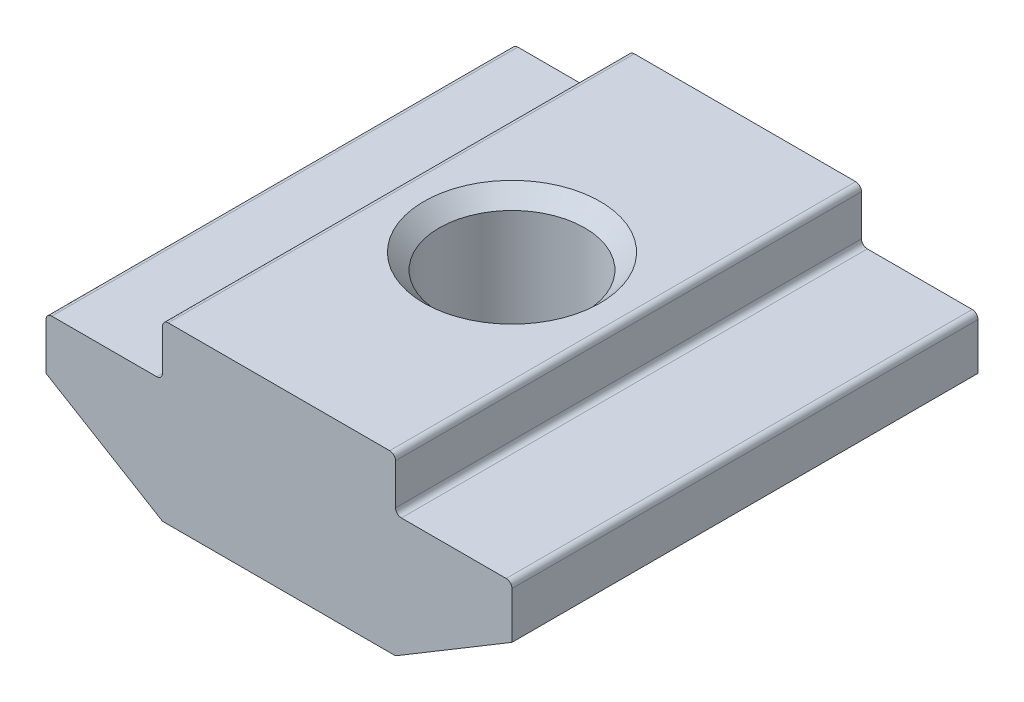
ISO-10303-21;
HEADER;
FILE_DESCRIPTION(('STEP AP214'),'2;1');
FILE_NAME('part.step','',(''),(''),'','','');
FILE_SCHEMA(('AUTOMOTIVE_DESIGN { 1 0 10303 214 1 1 1 1 }'));
ENDSEC;
DATA;
#1=APPLICATION_CONTEXT('core data for automotive mechanical design processes');
#2=APPLICATION_PROTOCOL_DEFINITION('international standard','automotive_design',2000,#1);
#3=PRODUCT_CONTEXT('',#1,'mechanical');
#4=PRODUCT('Part','Part','',(#3));
#5=PRODUCT_RELATED_PRODUCT_CATEGORY('part','',(#4));
#6=PRODUCT_DEFINITION_FORMATION('','',#4);
#7=PRODUCT_DEFINITION_CONTEXT('part definition',#1,'design');
#8=PRODUCT_DEFINITION('design','',#6,#7);
#9=PRODUCT_DEFINITION_SHAPE('','',#8);
#10=(LENGTH_UNIT() NAMED_UNIT(*) SI_UNIT(.MILLI.,.METRE.));
#11=(NAMED_UNIT(*) PLANE_ANGLE_UNIT() SI_UNIT($,.RADIAN.));
#12=(NAMED_UNIT(*) SI_UNIT($,.STERADIAN.) SOLID_ANGLE_UNIT());
#13=UNCERTAINTY_MEASURE_WITH_UNIT(LENGTH_MEASURE(1.E-05),#10,'distance_accuracy_value','');
#14=(GEOMETRIC_REPRESENTATION_CONTEXT(3) GLOBAL_UNCERTAINTY_ASSIGNED_CONTEXT((#13)) GLOBAL_UNIT_ASSIGNED_CONTEXT((#10,
#11,#12)) REPRESENTATION_CONTEXT('',''));
#15=CARTESIAN_POINT('',(0.,0.,0.));
#16=DIRECTION('',(0.,0.,1.));
#17=DIRECTION('',(1.,0.,0.));
#18=AXIS2_PLACEMENT_3D('',#15,#16,#17);
#19=CARTESIAN_POINT('',(-4.,0.,8.));
#20=DIRECTION('',(1.,0.,0.));
#21=DIRECTION('',(0.,0.,-1.));
#22=AXIS2_PLACEMENT_3D('',#19,#20,#21);
#23=PLANE('',#22);
#24=DIRECTION('',(0.,-1.,0.));
#25=VECTOR('',#24,1.);
#26=CARTESIAN_POINT('',(-4.,0.,8.));
#27=LINE('',#26,#25);
#28=CARTESIAN_POINT('',(-4.,-0.200000000000002,8.));
#29=VERTEX_POINT('',#28);
#30=CARTESIAN_POINT('',(-4.,-1.6,8.));
#31=VERTEX_POINT('',#30);
#32=EDGE_CURVE('E234',#29,#31,#27,.T.);
#33=ORIENTED_EDGE('',*,*,#32,.F.);
#34=DIRECTION('',(0.,0.,-1.));
#35=VECTOR('',#34,1.);
#36=CARTESIAN_POINT('',(-4.,-0.200000000000002,8.));
#37=LINE('',#36,#35);
#38=CARTESIAN_POINT('',(-4.,-0.200000000000002,-8.));
#39=VERTEX_POINT('',#38);
#40=EDGE_CURVE('E285',#29,#39,#37,.T.);
#41=ORIENTED_EDGE('',*,*,#40,.T.);
#42=DIRECTION('',(0.,-1.,0.));
#43=VECTOR('',#42,1.);
#44=CARTESIAN_POINT('',(-4.,0.,-8.));
#45=LINE('',#44,#43);
#46=CARTESIAN_POINT('',(-4.,-1.6,-8.));
#47=VERTEX_POINT('',#46);
#48=EDGE_CURVE('E208',#39,#47,#45,.T.);
#49=ORIENTED_EDGE('',*,*,#48,.T.);
#50=DIRECTION('',(0.,0.,-1.));
#51=VECTOR('',#50,1.);
#52=CARTESIAN_POINT('',(-4.,-1.6,8.));
#53=LINE('',#52,#51);
#54=EDGE_CURVE('E283',#47,#31,#53,.F.);
#55=ORIENTED_EDGE('',*,*,#54,.T.);
#56=EDGE_LOOP('',(#33,#41,#49,#55));
#57=FACE_BOUND('',#56,.T.);
#58=ADVANCED_FACE('F37',(#57),#23,.F.);
#59=CARTESIAN_POINT('',(-4.,-1.8,8.));
#60=DIRECTION('',(0.,-1.,0.));
#61=DIRECTION('',(1.,0.,0.));
#62=AXIS2_PLACEMENT_3D('',#59,#60,#61);
#63=PLANE('',#62);
#64=DIRECTION('',(-1.,0.,0.));
#65=VECTOR('',#64,1.);
#66=CARTESIAN_POINT('',(-4.,-1.8,-8.));
#67=LINE('',#66,#65);
#68=CARTESIAN_POINT('',(-4.2,-1.8,-8.));
#69=VERTEX_POINT('',#68);
#70=CARTESIAN_POINT('',(-7.8,-1.8,-8.));
#71=VERTEX_POINT('',#70);
#72=EDGE_CURVE('E211',#69,#71,#67,.T.);
#73=ORIENTED_EDGE('',*,*,#72,.T.);
#74=DIRECTION('',(0.,0.,-1.));
#75=VECTOR('',#74,1.);
#76=CARTESIAN_POINT('',(-7.8,-1.8,8.));
#77=LINE('',#76,#75);
#78=CARTESIAN_POINT('',(-7.8,-1.8,8.));
#79=VERTEX_POINT('',#78);
#80=EDGE_CURVE('E293',#71,#79,#77,.F.);
#81=ORIENTED_EDGE('',*,*,#80,.T.);
#82=DIRECTION('',(-1.,0.,0.));
#83=VECTOR('',#82,1.);
#84=CARTESIAN_POINT('',(-4.,-1.8,8.));
#85=LINE('',#84,#83);
#86=CARTESIAN_POINT('',(-4.2,-1.8,8.));
#87=VERTEX_POINT('',#86);
#88=EDGE_CURVE('E175',#87,#79,#85,.T.);
#89=ORIENTED_EDGE('',*,*,#88,.F.);
#90=DIRECTION('',(0.,0.,-1.));
#91=VECTOR('',#90,1.);
#92=CARTESIAN_POINT('',(-4.2,-1.8,-8.));
#93=LINE('',#92,#91);
#94=EDGE_CURVE('E290',#87,#69,#93,.T.);
#95=ORIENTED_EDGE('',*,*,#94,.T.);
#96=EDGE_LOOP('',(#73,#81,#89,#95));
#97=FACE_BOUND('',#96,.T.);
#98=ADVANCED_FACE('F313',(#97),#63,.F.);
#99=CARTESIAN_POINT('',(-8.,-1.8,8.));
#100=DIRECTION('',(1.,0.,0.));
#101=DIRECTION('',(0.,0.,-1.));
#102=AXIS2_PLACEMENT_3D('',#99,#100,#101);
#103=PLANE('',#102);
#104=DIRECTION('',(0.,-1.,0.));
#105=VECTOR('',#104,1.);
#106=CARTESIAN_POINT('',(-8.,-1.8,8.));
#107=LINE('',#106,#105);
#108=CARTESIAN_POINT('',(-8.,-2.,8.));
#109=VERTEX_POINT('',#108);
#110=CARTESIAN_POINT('',(-8.,-3.6,8.));
#111=VERTEX_POINT('',#110);
#112=EDGE_CURVE('E162',#109,#111,#107,.T.);
#113=ORIENTED_EDGE('',*,*,#112,.F.);
#114=DIRECTION('',(0.,0.,-1.));
#115=VECTOR('',#114,1.);
#116=CARTESIAN_POINT('',(-8.,-2.,8.));
#117=LINE('',#116,#115);
#118=CARTESIAN_POINT('',(-8.,-2.,-8.));
#119=VERTEX_POINT('',#118);
#120=EDGE_CURVE('E288',#109,#119,#117,.T.);
#121=ORIENTED_EDGE('',*,*,#120,.T.);
#122=DIRECTION('',(0.,-1.,0.));
#123=VECTOR('',#122,1.);
#124=CARTESIAN_POINT('',(-8.,-1.8,-8.));
#125=LINE('',#124,#123);
#126=CARTESIAN_POINT('',(-8.,-3.6,-8.));
#127=VERTEX_POINT('',#126);
#128=EDGE_CURVE('E181',#119,#127,#125,.T.);
#129=ORIENTED_EDGE('',*,*,#128,.T.);
#130=DIRECTION('',(0.,0.,-1.));
#131=VECTOR('',#130,1.);
#132=CARTESIAN_POINT('',(-8.,-3.6,8.));
#133=LINE('',#132,#131);
#134=EDGE_CURVE('E178',#111,#127,#133,.T.);
#135=ORIENTED_EDGE('',*,*,#134,.F.);
#136=EDGE_LOOP('',(#113,#121,#129,#135));
#137=FACE_BOUND('',#136,.T.);
#138=ADVANCED_FACE('F179',(#137),#103,.F.);
#139=CARTESIAN_POINT('',(-8.,-3.6,8.));
#140=DIRECTION('',(0.514495755427527,0.857492925712544,0.));
#141=DIRECTION('',(-0.857492925712544,0.514495755427527,0.));
#142=AXIS2_PLACEMENT_3D('',#139,#140,#141);
#143=PLANE('',#142);
#144=DIRECTION('',(0.857492925712544,-0.514495755427527,0.));
#145=VECTOR('',#144,1.);
#146=CARTESIAN_POINT('',(-8.,-3.6,-8.));
#147=LINE('',#146,#145);
#148=CARTESIAN_POINT('',(-4.04750235809582,-5.97149858514251,-8.));
#149=VERTEX_POINT('',#148);
#150=EDGE_CURVE('E216',#127,#149,#147,.T.);
#151=ORIENTED_EDGE('',*,*,#150,.T.);
#152=DIRECTION('',(0.,0.,-1.));
#153=VECTOR('',#152,1.);
#154=CARTESIAN_POINT('',(-4.04750235809582,-5.97149858514251,8.));
#155=LINE('',#154,#153);
#156=CARTESIAN_POINT('',(-4.04750235809582,-5.97149858514251,8.));
#157=VERTEX_POINT('',#156);
#158=EDGE_CURVE('E190',#149,#157,#155,.F.);
#159=ORIENTED_EDGE('',*,*,#158,.T.);
#160=DIRECTION('',(0.857492925712544,-0.514495755427527,0.));
#161=VECTOR('',#160,1.);
#162=CARTESIAN_POINT('',(-8.,-3.6,8.));
#163=LINE('',#162,#161);
#164=EDGE_CURVE('E167',#111,#157,#163,.T.);
#165=ORIENTED_EDGE('',*,*,#164,.F.);
#166=ORIENTED_EDGE('',*,*,#134,.T.);
#167=EDGE_LOOP('',(#151,#159,#165,#166));
#168=FACE_BOUND('',#167,.T.);
#169=ADVANCED_FACE('F188',(#168),#143,.F.);
#170=CARTESIAN_POINT('',(-4.,-6.,8.));
#171=DIRECTION('',(0.,1.,0.));
#172=DIRECTION('',(0.,0.,1.));
#173=AXIS2_PLACEMENT_3D('',#170,#171,#172);
#174=PLANE('',#173);
#175=CARTESIAN_POINT('',(0.,-6.,0.));
#176=DIRECTION('',(0.,1.,0.));
#177=DIRECTION('',(0.,0.,1.));
#178=AXIS2_PLACEMENT_3D('',#175,#176,#177);
#179=CIRCLE('',#178,3.025);
#180=CARTESIAN_POINT('',(0.,-6.,3.025));
#181=VERTEX_POINT('',#180);
#182=EDGE_CURVE('E325',#181,#181,#179,.T.);
#183=ORIENTED_EDGE('',*,*,#182,.T.);
#184=EDGE_LOOP('',(#183));
#185=FACE_BOUND('',#184,.T.);
#186=DIRECTION('',(1.,0.,0.));
#187=VECTOR('',#186,1.);
#188=CARTESIAN_POINT('',(-4.,-6.,-8.));
#189=LINE('',#188,#187);
#190=CARTESIAN_POINT('',(-3.94460320701031,-6.,-8.));
#191=VERTEX_POINT('',#190);
#192=CARTESIAN_POINT('',(3.94460320701031,-6.,-8.));
#193=VERTEX_POINT('',#192);
#194=EDGE_CURVE('E218',#191,#193,#189,.T.);
#195=ORIENTED_EDGE('',*,*,#194,.T.);
#196=DIRECTION('',(0.,0.,-1.));
#197=VECTOR('',#196,1.);
#198=CARTESIAN_POINT('',(3.94460320701031,-6.,8.));
#199=LINE('',#198,#197);
#200=CARTESIAN_POINT('',(3.94460320701031,-6.,8.));
#201=VERTEX_POINT('',#200);
#202=EDGE_CURVE('E254',#193,#201,#199,.F.);
#203=ORIENTED_EDGE('',*,*,#202,.T.);
#204=DIRECTION('',(1.,0.,0.));
#205=VECTOR('',#204,1.);
#206=CARTESIAN_POINT('',(-4.,-6.,8.));
#207=LINE('',#206,#205);
#208=CARTESIAN_POINT('',(-3.94460320701031,-6.,8.));
#209=VERTEX_POINT('',#208);
#210=EDGE_CURVE('E191',#209,#201,#207,.T.);
#211=ORIENTED_EDGE('',*,*,#210,.F.);
#212=DIRECTION('',(0.,0.,-1.));
#213=VECTOR('',#212,1.);
#214=CARTESIAN_POINT('',(-3.94460320701031,-6.,8.));
#215=LINE('',#214,#213);
#216=EDGE_CURVE('E251',#209,#191,#215,.T.);
#217=ORIENTED_EDGE('',*,*,#216,.T.);
#218=EDGE_LOOP('',(#195,#203,#211,#217));
#219=FACE_BOUND('',#218,.T.);
#220=ADVANCED_FACE('F329',(#185,#219),#174,.F.);
#221=CARTESIAN_POINT('',(8.,-3.6,8.));
#222=DIRECTION('',(-0.514495755427527,0.857492925712544,0.));
#223=DIRECTION('',(-0.857492925712544,-0.514495755427527,0.));
#224=AXIS2_PLACEMENT_3D('',#221,#222,#223);
#225=PLANE('',#224);
#226=DIRECTION('',(0.857492925712544,0.514495755427527,0.));
#227=VECTOR('',#226,1.);
#228=CARTESIAN_POINT('',(8.,-3.6,8.));
#229=LINE('',#228,#227);
#230=CARTESIAN_POINT('',(4.04750235809582,-5.97149858514251,8.));
#231=VERTEX_POINT('',#230);
#232=CARTESIAN_POINT('',(8.,-3.6,8.));
#233=VERTEX_POINT('',#232);
#234=EDGE_CURVE('E193',#231,#233,#229,.T.);
#235=ORIENTED_EDGE('',*,*,#234,.F.);
#236=DIRECTION('',(0.,0.,-1.));
#237=VECTOR('',#236,1.);
#238=CARTESIAN_POINT('',(4.04750235809582,-5.97149858514251,8.));
#239=LINE('',#238,#237);
#240=CARTESIAN_POINT('',(4.04750235809582,-5.97149858514251,-8.));
#241=VERTEX_POINT('',#240);
#242=EDGE_CURVE('E185',#231,#241,#239,.T.);
#243=ORIENTED_EDGE('',*,*,#242,.T.);
#244=DIRECTION('',(0.857492925712544,0.514495755427527,0.));
#245=VECTOR('',#244,1.);
#246=CARTESIAN_POINT('',(8.,-3.6,-8.));
#247=LINE('',#246,#245);
#248=CARTESIAN_POINT('',(8.,-3.6,-8.));
#249=VERTEX_POINT('',#248);
#250=EDGE_CURVE('E221',#241,#249,#247,.T.);
#251=ORIENTED_EDGE('',*,*,#250,.T.);
#252=DIRECTION('',(0.,0.,-1.));
#253=VECTOR('',#252,1.);
#254=CARTESIAN_POINT('',(8.,-3.6,8.));
#255=LINE('',#254,#253);
#256=EDGE_CURVE('E186',#233,#249,#255,.T.);
#257=ORIENTED_EDGE('',*,*,#256,.F.);
#258=EDGE_LOOP('',(#235,#243,#251,#257));
#259=FACE_BOUND('',#258,.T.);
#260=ADVANCED_FACE('F385',(#259),#225,.F.);
#261=CARTESIAN_POINT('',(8.,-1.8,8.));
#262=DIRECTION('',(-1.,0.,0.));
#263=DIRECTION('',(0.,0.,1.));
#264=AXIS2_PLACEMENT_3D('',#261,#262,#263);
#265=PLANE('',#264);
#266=DIRECTION('',(0.,1.,0.));
#267=VECTOR('',#266,1.);
#268=CARTESIAN_POINT('',(8.,-1.8,-8.));
#269=LINE('',#268,#267);
#270=CARTESIAN_POINT('',(8.,-2.,-8.));
#271=VERTEX_POINT('',#270);
#272=EDGE_CURVE('E223',#249,#271,#269,.T.);
#273=ORIENTED_EDGE('',*,*,#272,.T.);
#274=DIRECTION('',(0.,0.,-1.));
#275=VECTOR('',#274,1.);
#276=CARTESIAN_POINT('',(8.,-2.,8.));
#277=LINE('',#276,#275);
#278=CARTESIAN_POINT('',(8.,-2.,8.));
#279=VERTEX_POINT('',#278);
#280=EDGE_CURVE('E272',#271,#279,#277,.F.);
#281=ORIENTED_EDGE('',*,*,#280,.T.);
#282=DIRECTION('',(0.,1.,0.));
#283=VECTOR('',#282,1.);
#284=CARTESIAN_POINT('',(8.,-1.8,8.));
#285=LINE('',#284,#283);
#286=EDGE_CURVE('E198',#233,#279,#285,.T.);
#287=ORIENTED_EDGE('',*,*,#286,.F.);
#288=ORIENTED_EDGE('',*,*,#256,.T.);
#289=EDGE_LOOP('',(#273,#281,#287,#288));
#290=FACE_BOUND('',#289,.T.);
#291=ADVANCED_FACE('F380',(#290),#265,.F.);
#292=CARTESIAN_POINT('',(4.,-1.8,8.));
#293=DIRECTION('',(0.,-1.,0.));
#294=DIRECTION('',(1.,0.,0.));
#295=AXIS2_PLACEMENT_3D('',#292,#293,#294);
#296=PLANE('',#295);
#297=DIRECTION('',(-1.,0.,0.));
#298=VECTOR('',#297,1.);
#299=CARTESIAN_POINT('',(4.,-1.8,8.));
#300=LINE('',#299,#298);
#301=CARTESIAN_POINT('',(7.8,-1.8,8.));
#302=VERTEX_POINT('',#301);
#303=CARTESIAN_POINT('',(4.2,-1.8,8.));
#304=VERTEX_POINT('',#303);
#305=EDGE_CURVE('E201',#302,#304,#300,.T.);
#306=ORIENTED_EDGE('',*,*,#305,.F.);
#307=DIRECTION('',(0.,0.,-1.));
#308=VECTOR('',#307,1.);
#309=CARTESIAN_POINT('',(7.8,-1.8,8.));
#310=LINE('',#309,#308);
#311=CARTESIAN_POINT('',(7.8,-1.8,-8.));
#312=VERTEX_POINT('',#311);
#313=EDGE_CURVE('E269',#302,#312,#310,.T.);
#314=ORIENTED_EDGE('',*,*,#313,.T.);
#315=DIRECTION('',(-1.,0.,0.));
#316=VECTOR('',#315,1.);
#317=CARTESIAN_POINT('',(4.,-1.8,-8.));
#318=LINE('',#317,#316);
#319=CARTESIAN_POINT('',(4.2,-1.8,-8.));
#320=VERTEX_POINT('',#319);
#321=EDGE_CURVE('E226',#312,#320,#318,.T.);
#322=ORIENTED_EDGE('',*,*,#321,.T.);
#323=DIRECTION('',(0.,0.,-1.));
#324=VECTOR('',#323,1.);
#325=CARTESIAN_POINT('',(4.2,-1.8,8.));
#326=LINE('',#325,#324);
#327=EDGE_CURVE('E267',#320,#304,#326,.F.);
#328=ORIENTED_EDGE('',*,*,#327,.T.);
#329=EDGE_LOOP('',(#306,#314,#322,#328));
#330=FACE_BOUND('',#329,.T.);
#331=ADVANCED_FACE('F372',(#330),#296,.F.);
#332=CARTESIAN_POINT('',(4.,0.,8.));
#333=DIRECTION('',(-1.,0.,0.));
#334=DIRECTION('',(0.,0.,1.));
#335=AXIS2_PLACEMENT_3D('',#332,#333,#334);
#336=PLANE('',#335);
#337=DIRECTION('',(0.,1.,0.));
#338=VECTOR('',#337,1.);
#339=CARTESIAN_POINT('',(4.,0.,8.));
#340=LINE('',#339,#338);
#341=CARTESIAN_POINT('',(4.,-1.6,8.));
#342=VERTEX_POINT('',#341);
#343=CARTESIAN_POINT('',(4.,-0.199999999999998,8.));
#344=VERTEX_POINT('',#343);
#345=EDGE_CURVE('E204',#342,#344,#340,.T.);
#346=ORIENTED_EDGE('',*,*,#345,.F.);
#347=DIRECTION('',(0.,0.,-1.));
#348=VECTOR('',#347,1.);
#349=CARTESIAN_POINT('',(4.,-1.6,-8.));
#350=LINE('',#349,#348);
#351=CARTESIAN_POINT('',(4.,-1.6,-8.));
#352=VERTEX_POINT('',#351);
#353=EDGE_CURVE('E276',#342,#352,#350,.T.);
#354=ORIENTED_EDGE('',*,*,#353,.T.);
#355=DIRECTION('',(0.,1.,0.));
#356=VECTOR('',#355,1.);
#357=CARTESIAN_POINT('',(4.,0.,-8.));
#358=LINE('',#357,#356);
#359=CARTESIAN_POINT('',(4.,-0.199999999999998,-8.));
#360=VERTEX_POINT('',#359);
#361=EDGE_CURVE('E229',#352,#360,#358,.T.);
#362=ORIENTED_EDGE('',*,*,#361,.T.);
#363=DIRECTION('',(0.,0.,-1.));
#364=VECTOR('',#363,1.);
#365=CARTESIAN_POINT('',(4.,-0.199999999999998,8.));
#366=LINE('',#365,#364);
#367=EDGE_CURVE('E274',#360,#344,#366,.F.);
#368=ORIENTED_EDGE('',*,*,#367,.T.);
#369=EDGE_LOOP('',(#346,#354,#362,#368));
#370=FACE_BOUND('',#369,.T.);
#371=ADVANCED_FACE('F353',(#370),#336,.F.);
#372=CARTESIAN_POINT('',(4.,0.,8.));
#373=DIRECTION('',(0.,-1.,0.));
#374=DIRECTION('',(1.,0.,0.));
#375=AXIS2_PLACEMENT_3D('',#372,#373,#374);
#376=PLANE('',#375);
#377=CARTESIAN_POINT('',(0.,0.,0.));
#378=DIRECTION('',(0.,1.,0.));
#379=DIRECTION('',(0.,0.,1.));
#380=AXIS2_PLACEMENT_3D('',#377,#378,#379);
#381=CIRCLE('',#380,3.025);
#382=CARTESIAN_POINT('',(0.,0.,3.025));
#383=VERTEX_POINT('',#382);
#384=EDGE_CURVE('E322',#383,#383,#381,.T.);
#385=ORIENTED_EDGE('',*,*,#384,.F.);
#386=EDGE_LOOP('',(#385));
#387=FACE_BOUND('',#386,.T.);
#388=DIRECTION('',(-1.,0.,0.));
#389=VECTOR('',#388,1.);
#390=CARTESIAN_POINT('',(4.,0.,8.));
#391=LINE('',#390,#389);
#392=CARTESIAN_POINT('',(3.8,0.,8.));
#393=VERTEX_POINT('',#392);
#394=CARTESIAN_POINT('',(-3.8,0.,8.));
#395=VERTEX_POINT('',#394);
#396=EDGE_CURVE('E206',#393,#395,#391,.T.);
#397=ORIENTED_EDGE('',*,*,#396,.F.);
#398=DIRECTION('',(0.,0.,-1.));
#399=VECTOR('',#398,1.);
#400=CARTESIAN_POINT('',(3.8,0.,8.));
#401=LINE('',#400,#399);
#402=CARTESIAN_POINT('',(3.8,0.,-8.));
#403=VERTEX_POINT('',#402);
#404=EDGE_CURVE('E280',#393,#403,#401,.T.);
#405=ORIENTED_EDGE('',*,*,#404,.T.);
#406=DIRECTION('',(-1.,0.,0.));
#407=VECTOR('',#406,1.);
#408=CARTESIAN_POINT('',(4.,0.,-8.));
#409=LINE('',#408,#407);
#410=CARTESIAN_POINT('',(-3.8,0.,-8.));
#411=VERTEX_POINT('',#410);
#412=EDGE_CURVE('E232',#403,#411,#409,.T.);
#413=ORIENTED_EDGE('',*,*,#412,.T.);
#414=DIRECTION('',(0.,0.,-1.));
#415=VECTOR('',#414,1.);
#416=CARTESIAN_POINT('',(-3.8,0.,8.));
#417=LINE('',#416,#415);
#418=EDGE_CURVE('E52',#411,#395,#417,.F.);
#419=ORIENTED_EDGE('',*,*,#418,.T.);
#420=EDGE_LOOP('',(#397,#405,#413,#419));
#421=FACE_BOUND('',#420,.T.);
#422=ADVANCED_FACE('F351',(#387,#421),#376,.F.);
#423=CARTESIAN_POINT('',(0.,0.,8.));
#424=DIRECTION('',(0.,0.,-1.));
#425=DIRECTION('',(-1.,0.,0.));
#426=AXIS2_PLACEMENT_3D('',#423,#424,#425);
#427=PLANE('',#426);
#428=ORIENTED_EDGE('',*,*,#210,.T.);
#429=CARTESIAN_POINT('',(3.94460320701031,-5.8,8.));
#430=DIRECTION('',(0.,0.,-1.));
#431=DIRECTION('',(-1.,0.,0.));
#432=AXIS2_PLACEMENT_3D('',#429,#430,#431);
#433=CIRCLE('',#432,0.2);
#434=EDGE_CURVE('E264',#201,#231,#433,.F.);
#435=ORIENTED_EDGE('',*,*,#434,.T.);
#436=ORIENTED_EDGE('',*,*,#234,.T.);
#437=ORIENTED_EDGE('',*,*,#286,.T.);
#438=CARTESIAN_POINT('',(7.8,-2.,8.));
#439=DIRECTION('',(0.,0.,-1.));
#440=DIRECTION('',(-1.,0.,0.));
#441=AXIS2_PLACEMENT_3D('',#438,#439,#440);
#442=CIRCLE('',#441,0.2);
#443=EDGE_CURVE('E260',#279,#302,#442,.F.);
#444=ORIENTED_EDGE('',*,*,#443,.T.);
#445=ORIENTED_EDGE('',*,*,#305,.T.);
#446=CARTESIAN_POINT('',(4.2,-1.6,8.));
#447=DIRECTION('',(0.,0.,-1.));
#448=DIRECTION('',(-1.,0.,0.));
#449=AXIS2_PLACEMENT_3D('',#446,#447,#448);
#450=CIRCLE('',#449,0.2);
#451=EDGE_CURVE('E297',#304,#342,#450,.T.);
#452=ORIENTED_EDGE('',*,*,#451,.T.);
#453=ORIENTED_EDGE('',*,*,#345,.T.);
#454=CARTESIAN_POINT('',(3.8,-0.199999999999998,8.));
#455=DIRECTION('',(0.,0.,-1.));
#456=DIRECTION('',(-1.,0.,0.));
#457=AXIS2_PLACEMENT_3D('',#454,#455,#456);
#458=CIRCLE('',#457,0.2);
#459=EDGE_CURVE('E59',#344,#393,#458,.F.);
#460=ORIENTED_EDGE('',*,*,#459,.T.);
#461=ORIENTED_EDGE('',*,*,#396,.T.);
#462=CARTESIAN_POINT('',(-3.8,-0.200000000000002,8.));
#463=DIRECTION('',(0.,0.,-1.));
#464=DIRECTION('',(-1.,0.,0.));
#465=AXIS2_PLACEMENT_3D('',#462,#463,#464);
#466=CIRCLE('',#465,0.2);
#467=EDGE_CURVE('E257',#395,#29,#466,.F.);
#468=ORIENTED_EDGE('',*,*,#467,.T.);
#469=ORIENTED_EDGE('',*,*,#32,.T.);
#470=CARTESIAN_POINT('',(-4.2,-1.6,8.));
#471=DIRECTION('',(0.,0.,-1.));
#472=DIRECTION('',(-1.,0.,0.));
#473=AXIS2_PLACEMENT_3D('',#470,#471,#472);
#474=CIRCLE('',#473,0.2);
#475=EDGE_CURVE('E11',#31,#87,#474,.T.);
#476=ORIENTED_EDGE('',*,*,#475,.T.);
#477=ORIENTED_EDGE('',*,*,#88,.T.);
#478=CARTESIAN_POINT('',(-7.8,-2.,8.));
#479=DIRECTION('',(0.,0.,-1.));
#480=DIRECTION('',(-1.,0.,0.));
#481=AXIS2_PLACEMENT_3D('',#478,#479,#480);
#482=CIRCLE('',#481,0.2);
#483=EDGE_CURVE('E171',#79,#109,#482,.F.);
#484=ORIENTED_EDGE('',*,*,#483,.T.);
#485=ORIENTED_EDGE('',*,*,#112,.T.);
#486=ORIENTED_EDGE('',*,*,#164,.T.);
#487=CARTESIAN_POINT('',(-3.94460320701031,-5.8,8.));
#488=DIRECTION('',(0.,0.,-1.));
#489=DIRECTION('',(-1.,0.,0.));
#490=AXIS2_PLACEMENT_3D('',#487,#488,#489);
#491=CIRCLE('',#490,0.2);
#492=EDGE_CURVE('E262',#157,#209,#491,.F.);
#493=ORIENTED_EDGE('',*,*,#492,.T.);
#494=EDGE_LOOP('',(#428,#435,#436,#437,#444,#445,#452,#453,#460,#461,#468,#469,#476,#477,#484,
#485,#486,#493));
#495=FACE_BOUND('',#494,.T.);
#496=ADVANCED_FACE('F165',(#495),#427,.F.);
#497=CARTESIAN_POINT('',(0.,0.,-8.));
#498=DIRECTION('',(0.,0.,-1.));
#499=DIRECTION('',(-1.,0.,0.));
#500=AXIS2_PLACEMENT_3D('',#497,#498,#499);
#501=PLANE('',#500);
#502=ORIENTED_EDGE('',*,*,#250,.F.);
#503=CARTESIAN_POINT('',(3.94460320701031,-5.8,-8.));
#504=DIRECTION('',(0.,0.,-1.));
#505=DIRECTION('',(-1.,0.,0.));
#506=AXIS2_PLACEMENT_3D('',#503,#504,#505);
#507=CIRCLE('',#506,0.2);
#508=EDGE_CURVE('E249',#241,#193,#507,.T.);
#509=ORIENTED_EDGE('',*,*,#508,.T.);
#510=ORIENTED_EDGE('',*,*,#194,.F.);
#511=CARTESIAN_POINT('',(-3.94460320701031,-5.8,-8.));
#512=DIRECTION('',(0.,0.,-1.));
#513=DIRECTION('',(-1.,0.,0.));
#514=AXIS2_PLACEMENT_3D('',#511,#512,#513);
#515=CIRCLE('',#514,0.2);
#516=EDGE_CURVE('E247',#191,#149,#515,.T.);
#517=ORIENTED_EDGE('',*,*,#516,.T.);
#518=ORIENTED_EDGE('',*,*,#150,.F.);
#519=ORIENTED_EDGE('',*,*,#128,.F.);
#520=CARTESIAN_POINT('',(-7.8,-2.,-8.));
#521=DIRECTION('',(0.,0.,-1.));
#522=DIRECTION('',(-1.,0.,0.));
#523=AXIS2_PLACEMENT_3D('',#520,#521,#522);
#524=CIRCLE('',#523,0.2);
#525=EDGE_CURVE('E239',#119,#71,#524,.T.);
#526=ORIENTED_EDGE('',*,*,#525,.T.);
#527=ORIENTED_EDGE('',*,*,#72,.F.);
#528=CARTESIAN_POINT('',(-4.2,-1.6,-8.));
#529=DIRECTION('',(0.,0.,-1.));
#530=DIRECTION('',(-1.,0.,0.));
#531=AXIS2_PLACEMENT_3D('',#528,#529,#530);
#532=CIRCLE('',#531,0.2);
#533=EDGE_CURVE('E45',#69,#47,#532,.F.);
#534=ORIENTED_EDGE('',*,*,#533,.T.);
#535=ORIENTED_EDGE('',*,*,#48,.F.);
#536=CARTESIAN_POINT('',(-3.8,-0.200000000000002,-8.));
#537=DIRECTION('',(0.,0.,-1.));
#538=DIRECTION('',(-1.,0.,0.));
#539=AXIS2_PLACEMENT_3D('',#536,#537,#538);
#540=CIRCLE('',#539,0.2);
#541=EDGE_CURVE('E241',#39,#411,#540,.T.);
#542=ORIENTED_EDGE('',*,*,#541,.T.);
#543=ORIENTED_EDGE('',*,*,#412,.F.);
#544=CARTESIAN_POINT('',(3.8,-0.199999999999998,-8.));
#545=DIRECTION('',(0.,0.,-1.));
#546=DIRECTION('',(-1.,0.,0.));
#547=AXIS2_PLACEMENT_3D('',#544,#545,#546);
#548=CIRCLE('',#547,0.2);
#549=EDGE_CURVE('E243',#403,#360,#548,.T.);
#550=ORIENTED_EDGE('',*,*,#549,.T.);
#551=ORIENTED_EDGE('',*,*,#361,.F.);
#552=CARTESIAN_POINT('',(4.2,-1.6,-8.));
#553=DIRECTION('',(0.,0.,-1.));
#554=DIRECTION('',(-1.,0.,0.));
#555=AXIS2_PLACEMENT_3D('',#552,#553,#554);
#556=CIRCLE('',#555,0.2);
#557=EDGE_CURVE('E295',#352,#320,#556,.F.);
#558=ORIENTED_EDGE('',*,*,#557,.T.);
#559=ORIENTED_EDGE('',*,*,#321,.F.);
#560=CARTESIAN_POINT('',(7.8,-2.,-8.));
#561=DIRECTION('',(0.,0.,-1.));
#562=DIRECTION('',(-1.,0.,0.));
#563=AXIS2_PLACEMENT_3D('',#560,#561,#562);
#564=CIRCLE('',#563,0.2);
#565=EDGE_CURVE('E245',#312,#271,#564,.T.);
#566=ORIENTED_EDGE('',*,*,#565,.T.);
#567=ORIENTED_EDGE('',*,*,#272,.F.);
#568=EDGE_LOOP('',(#502,#509,#510,#517,#518,#519,#526,#527,#534,#535,#542,#543,#550,#551,#558,
#559,#566,#567));
#569=FACE_BOUND('',#568,.T.);
#570=ADVANCED_FACE('F302',(#569),#501,.T.);
#571=CARTESIAN_POINT('',(0.,-5.475,0.));
#572=DIRECTION('',(0.,-1.,0.));
#573=DIRECTION('',(0.,0.,-1.));
#574=AXIS2_PLACEMENT_3D('',#571,#572,#573);
#575=CONICAL_SURFACE('',#574,2.5,0.785398163397445);
#576=ORIENTED_EDGE('',*,*,#182,.F.);
#577=EDGE_LOOP('',(#576));
#578=FACE_BOUND('',#577,.T.);
#579=CARTESIAN_POINT('',(0.,-5.475,0.));
#580=DIRECTION('',(0.,1.,0.));
#581=DIRECTION('',(0.,0.,1.));
#582=AXIS2_PLACEMENT_3D('',#579,#580,#581);
#583=CIRCLE('',#582,2.5);
#584=CARTESIAN_POINT('',(0.,-5.475,2.5));
#585=VERTEX_POINT('',#584);
#586=EDGE_CURVE('E212',#585,#585,#583,.T.);
#587=ORIENTED_EDGE('',*,*,#586,.T.);
#588=EDGE_LOOP('',(#587));
#589=FACE_BOUND('',#588,.T.);
#590=ADVANCED_FACE('F332',(#578,#589),#575,.F.);
#591=CARTESIAN_POINT('',(0.,0.,0.));
#592=DIRECTION('',(0.,1.,0.));
#593=DIRECTION('',(0.,0.,1.));
#594=AXIS2_PLACEMENT_3D('',#591,#592,#593);
#595=CYLINDRICAL_SURFACE('',#594,2.5);
#596=ORIENTED_EDGE('',*,*,#586,.F.);
#597=EDGE_LOOP('',(#596));
#598=FACE_BOUND('',#597,.T.);
#599=CARTESIAN_POINT('',(0.,-0.524999999999999,0.));
#600=DIRECTION('',(0.,1.,0.));
#601=DIRECTION('',(0.,0.,1.));
#602=AXIS2_PLACEMENT_3D('',#599,#600,#601);
#603=CIRCLE('',#602,2.5);
#604=CARTESIAN_POINT('',(0.,-0.524999999999999,2.5));
#605=VERTEX_POINT('',#604);
#606=EDGE_CURVE('E319',#605,#605,#603,.T.);
#607=ORIENTED_EDGE('',*,*,#606,.T.);
#608=EDGE_LOOP('',(#607));
#609=FACE_BOUND('',#608,.T.);
#610=ADVANCED_FACE('F335',(#598,#609),#595,.F.);
#611=CARTESIAN_POINT('',(0.,0.,0.));
#612=DIRECTION('',(0.,1.,0.));
#613=DIRECTION('',(0.,0.,1.));
#614=AXIS2_PLACEMENT_3D('',#611,#612,#613);
#615=CONICAL_SURFACE('',#614,3.025,0.78539816339745);
#616=ORIENTED_EDGE('',*,*,#606,.F.);
#617=EDGE_LOOP('',(#616));
#618=FACE_BOUND('',#617,.T.);
#619=ORIENTED_EDGE('',*,*,#384,.T.);
#620=EDGE_LOOP('',(#619));
#621=FACE_BOUND('',#620,.T.);
#622=ADVANCED_FACE('F341',(#618,#621),#615,.F.);
#623=CARTESIAN_POINT('',(3.94460320701031,-5.8,8.));
#624=DIRECTION('',(0.,0.,-1.));
#625=DIRECTION('',(-1.,0.,0.));
#626=AXIS2_PLACEMENT_3D('',#623,#624,#625);
#627=CYLINDRICAL_SURFACE('',#626,0.2);
#628=ORIENTED_EDGE('',*,*,#434,.F.);
#629=ORIENTED_EDGE('',*,*,#202,.F.);
#630=ORIENTED_EDGE('',*,*,#508,.F.);
#631=ORIENTED_EDGE('',*,*,#242,.F.);
#632=EDGE_LOOP('',(#628,#629,#630,#631));
#633=FACE_BOUND('',#632,.T.);
#634=ADVANCED_FACE('F347',(#633),#627,.T.);
#635=CARTESIAN_POINT('',(-3.94460320701031,-5.8,8.));
#636=DIRECTION('',(0.,0.,-1.));
#637=DIRECTION('',(-1.,0.,0.));
#638=AXIS2_PLACEMENT_3D('',#635,#636,#637);
#639=CYLINDRICAL_SURFACE('',#638,0.2);
#640=ORIENTED_EDGE('',*,*,#492,.F.);
#641=ORIENTED_EDGE('',*,*,#158,.F.);
#642=ORIENTED_EDGE('',*,*,#516,.F.);
#643=ORIENTED_EDGE('',*,*,#216,.F.);
#644=EDGE_LOOP('',(#640,#641,#642,#643));
#645=FACE_BOUND('',#644,.T.);
#646=ADVANCED_FACE('F394',(#645),#639,.T.);
#647=CARTESIAN_POINT('',(7.8,-2.,8.));
#648=DIRECTION('',(0.,0.,-1.));
#649=DIRECTION('',(-1.,0.,0.));
#650=AXIS2_PLACEMENT_3D('',#647,#648,#649);
#651=CYLINDRICAL_SURFACE('',#650,0.2);
#652=ORIENTED_EDGE('',*,*,#443,.F.);
#653=ORIENTED_EDGE('',*,*,#280,.F.);
#654=ORIENTED_EDGE('',*,*,#565,.F.);
#655=ORIENTED_EDGE('',*,*,#313,.F.);
#656=EDGE_LOOP('',(#652,#653,#654,#655));
#657=FACE_BOUND('',#656,.T.);
#658=ADVANCED_FACE('F376',(#657),#651,.T.);
#659=CARTESIAN_POINT('',(4.2,-1.6,8.));
#660=DIRECTION('',(0.,0.,1.));
#661=DIRECTION('',(1.,0.,0.));
#662=AXIS2_PLACEMENT_3D('',#659,#660,#661);
#663=CYLINDRICAL_SURFACE('',#662,0.2);
#664=ORIENTED_EDGE('',*,*,#451,.F.);
#665=ORIENTED_EDGE('',*,*,#327,.F.);
#666=ORIENTED_EDGE('',*,*,#557,.F.);
#667=ORIENTED_EDGE('',*,*,#353,.F.);
#668=EDGE_LOOP('',(#664,#665,#666,#667));
#669=FACE_BOUND('',#668,.T.);
#670=ADVANCED_FACE('F367',(#669),#663,.F.);
#671=CARTESIAN_POINT('',(3.8,-0.199999999999998,8.));
#672=DIRECTION('',(0.,0.,-1.));
#673=DIRECTION('',(-1.,0.,0.));
#674=AXIS2_PLACEMENT_3D('',#671,#672,#673);
#675=CYLINDRICAL_SURFACE('',#674,0.2);
#676=ORIENTED_EDGE('',*,*,#459,.F.);
#677=ORIENTED_EDGE('',*,*,#367,.F.);
#678=ORIENTED_EDGE('',*,*,#549,.F.);
#679=ORIENTED_EDGE('',*,*,#404,.F.);
#680=EDGE_LOOP('',(#676,#677,#678,#679));
#681=FACE_BOUND('',#680,.T.);
#682=ADVANCED_FACE('F359',(#681),#675,.T.);
#683=CARTESIAN_POINT('',(-3.8,-0.200000000000002,8.));
#684=DIRECTION('',(0.,0.,-1.));
#685=DIRECTION('',(-1.,0.,0.));
#686=AXIS2_PLACEMENT_3D('',#683,#684,#685);
#687=CYLINDRICAL_SURFACE('',#686,0.2);
#688=ORIENTED_EDGE('',*,*,#467,.F.);
#689=ORIENTED_EDGE('',*,*,#418,.F.);
#690=ORIENTED_EDGE('',*,*,#541,.F.);
#691=ORIENTED_EDGE('',*,*,#40,.F.);
#692=EDGE_LOOP('',(#688,#689,#690,#691));
#693=FACE_BOUND('',#692,.T.);
#694=ADVANCED_FACE('F398',(#693),#687,.T.);
#695=CARTESIAN_POINT('',(-7.8,-2.,8.));
#696=DIRECTION('',(0.,0.,-1.));
#697=DIRECTION('',(-1.,0.,0.));
#698=AXIS2_PLACEMENT_3D('',#695,#696,#697);
#699=CYLINDRICAL_SURFACE('',#698,0.2);
#700=ORIENTED_EDGE('',*,*,#483,.F.);
#701=ORIENTED_EDGE('',*,*,#80,.F.);
#702=ORIENTED_EDGE('',*,*,#525,.F.);
#703=ORIENTED_EDGE('',*,*,#120,.F.);
#704=EDGE_LOOP('',(#700,#701,#702,#703));
#705=FACE_BOUND('',#704,.T.);
#706=ADVANCED_FACE('F396',(#705),#699,.T.);
#707=CARTESIAN_POINT('',(-4.2,-1.6,8.));
#708=DIRECTION('',(0.,0.,1.));
#709=DIRECTION('',(1.,0.,0.));
#710=AXIS2_PLACEMENT_3D('',#707,#708,#709);
#711=CYLINDRICAL_SURFACE('',#710,0.2);
#712=ORIENTED_EDGE('',*,*,#475,.F.);
#713=ORIENTED_EDGE('',*,*,#54,.F.);
#714=ORIENTED_EDGE('',*,*,#533,.F.);
#715=ORIENTED_EDGE('',*,*,#94,.F.);
#716=EDGE_LOOP('',(#712,#713,#714,#715));
#717=FACE_BOUND('',#716,.T.);
#718=ADVANCED_FACE('F39',(#717),#711,.F.);
#719=CLOSED_SHELL('',(#58,#98,#138,#169,#220,#260,#291,#331,#371,#422,#496,#570,#590,#610,#622,
#634,#646,#658,#670,#682,#694,#706,#718));
#720=MANIFOLD_SOLID_BREP('B2',#719);
#721=ADVANCED_BREP_SHAPE_REPRESENTATION('',(#18,#720),#14);
#722=SHAPE_DEFINITION_REPRESENTATION(#9,#721);
ENDSEC;
END-ISO-10303-21;
